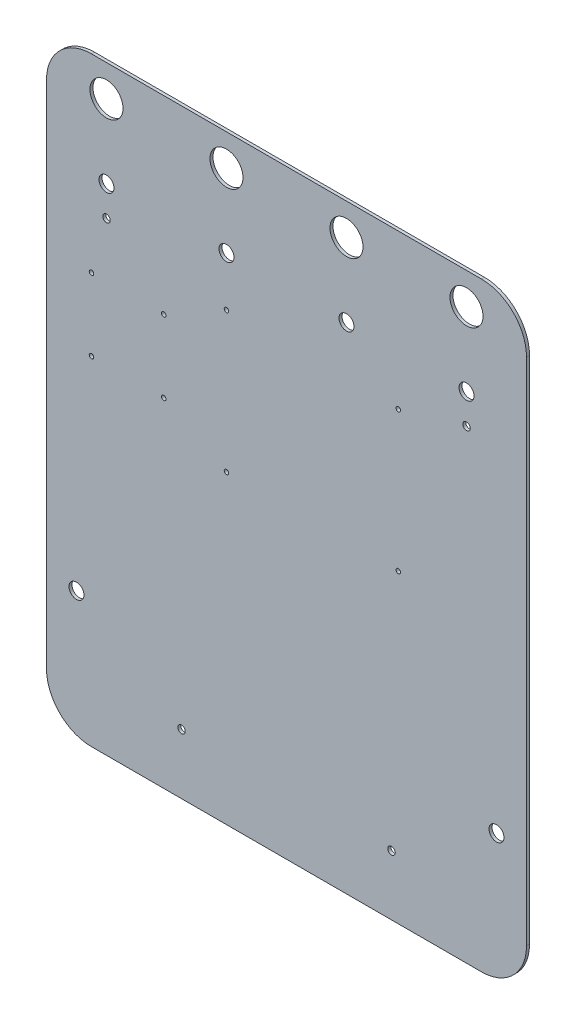
ISO-10303-21;
HEADER;
FILE_DESCRIPTION(('STEP AP214'),'2;1');
FILE_NAME('part.step','',(''),(''),'','','');
FILE_SCHEMA(('AUTOMOTIVE_DESIGN { 1 0 10303 214 1 1 1 1 }'));
ENDSEC;
DATA;
#1=APPLICATION_CONTEXT('core data for automotive mechanical design processes');
#2=APPLICATION_PROTOCOL_DEFINITION('international standard','automotive_design',2000,#1);
#3=PRODUCT_CONTEXT('',#1,'mechanical');
#4=PRODUCT('Part','Part','',(#3));
#5=PRODUCT_RELATED_PRODUCT_CATEGORY('part','',(#4));
#6=PRODUCT_DEFINITION_FORMATION('','',#4);
#7=PRODUCT_DEFINITION_CONTEXT('part definition',#1,'design');
#8=PRODUCT_DEFINITION('design','',#6,#7);
#9=PRODUCT_DEFINITION_SHAPE('','',#8);
#10=(LENGTH_UNIT() NAMED_UNIT(*) SI_UNIT(.MILLI.,.METRE.));
#11=(NAMED_UNIT(*) PLANE_ANGLE_UNIT() SI_UNIT($,.RADIAN.));
#12=(NAMED_UNIT(*) SI_UNIT($,.STERADIAN.) SOLID_ANGLE_UNIT());
#13=UNCERTAINTY_MEASURE_WITH_UNIT(LENGTH_MEASURE(1.E-05),#10,'distance_accuracy_value','');
#14=(GEOMETRIC_REPRESENTATION_CONTEXT(3) GLOBAL_UNCERTAINTY_ASSIGNED_CONTEXT((#13)) GLOBAL_UNIT_ASSIGNED_CONTEXT((#10,
#11,#12)) REPRESENTATION_CONTEXT('',''));
#15=CARTESIAN_POINT('',(0.,0.,0.));
#16=DIRECTION('',(0.,0.,1.));
#17=DIRECTION('',(1.,0.,0.));
#18=AXIS2_PLACEMENT_3D('',#15,#16,#17);
#19=CARTESIAN_POINT('',(59.4029850746268,-20.,2.));
#20=DIRECTION('',(0.,0.,1.));
#21=DIRECTION('',(1.,0.,0.));
#22=AXIS2_PLACEMENT_3D('',#19,#20,#21);
#23=PLANE('',#22);
#24=CARTESIAN_POINT('',(-200.598097779219,175.469448038988,2.));
#25=DIRECTION('',(0.,0.,1.));
#26=DIRECTION('',(1.,0.,0.));
#27=AXIS2_PLACEMENT_3D('',#24,#25,#26);
#28=CIRCLE('',#27,1.5);
#29=CARTESIAN_POINT('',(-199.098097779219,175.469448038988,2.));
#30=VERTEX_POINT('',#29);
#31=EDGE_CURVE('E300',#30,#30,#28,.T.);
#32=ORIENTED_EDGE('',*,*,#31,.F.);
#33=EDGE_LOOP('',(#32));
#34=FACE_BOUND('',#33,.T.);
#35=CARTESIAN_POINT('',(-200.598097779219,223.669448038988,2.));
#36=DIRECTION('',(0.,0.,1.));
#37=DIRECTION('',(1.,0.,0.));
#38=AXIS2_PLACEMENT_3D('',#35,#36,#37);
#39=CIRCLE('',#38,1.49999999999995);
#40=CARTESIAN_POINT('',(-199.098097779219,223.669448038988,2.));
#41=VERTEX_POINT('',#40);
#42=EDGE_CURVE('E288',#41,#41,#39,.T.);
#43=ORIENTED_EDGE('',*,*,#42,.F.);
#44=EDGE_LOOP('',(#43));
#45=FACE_BOUND('',#44,.T.);
#46=CARTESIAN_POINT('',(3.90070572618083,153.604711047451,2.));
#47=DIRECTION('',(0.,0.,1.));
#48=DIRECTION('',(1.,0.,0.));
#49=AXIS2_PLACEMENT_3D('',#46,#47,#48);
#50=CIRCLE('',#49,1.5);
#51=CARTESIAN_POINT('',(5.40070572618083,153.604711047451,2.));
#52=VERTEX_POINT('',#51);
#53=EDGE_CURVE('E276',#52,#52,#50,.T.);
#54=ORIENTED_EDGE('',*,*,#53,.F.);
#55=EDGE_LOOP('',(#54));
#56=FACE_BOUND('',#55,.T.);
#57=CARTESIAN_POINT('',(49.4052224955762,280.,2.));
#58=DIRECTION('',(0.,0.,1.));
#59=DIRECTION('',(1.,0.,0.));
#60=AXIS2_PLACEMENT_3D('',#57,#58,#59);
#61=CIRCLE('',#60,5.);
#62=CARTESIAN_POINT('',(54.4052224955762,280.,2.));
#63=VERTEX_POINT('',#62);
#64=EDGE_CURVE('E264',#63,#63,#61,.T.);
#65=ORIENTED_EDGE('',*,*,#64,.F.);
#66=EDGE_LOOP('',(#65));
#67=FACE_BOUND('',#66,.T.);
#68=CARTESIAN_POINT('',(-30.5970149253732,280.,2.));
#69=DIRECTION('',(0.,0.,1.));
#70=DIRECTION('',(1.,0.,0.));
#71=AXIS2_PLACEMENT_3D('',#68,#69,#70);
#72=CIRCLE('',#71,5.);
#73=CARTESIAN_POINT('',(-25.5970149253732,280.,2.));
#74=VERTEX_POINT('',#73);
#75=EDGE_CURVE('E252',#74,#74,#72,.T.);
#76=ORIENTED_EDGE('',*,*,#75,.F.);
#77=EDGE_LOOP('',(#76));
#78=FACE_BOUND('',#77,.T.);
#79=CARTESIAN_POINT('',(69.4029850746269,35.,2.));
#80=DIRECTION('',(0.,0.,1.));
#81=DIRECTION('',(1.,0.,0.));
#82=AXIS2_PLACEMENT_3D('',#79,#80,#81);
#83=CIRCLE('',#82,5.00000000000001);
#84=CARTESIAN_POINT('',(74.4029850746269,35.,2.));
#85=VERTEX_POINT('',#84);
#86=EDGE_CURVE('E240',#85,#85,#83,.T.);
#87=ORIENTED_EDGE('',*,*,#86,.F.);
#88=EDGE_LOOP('',(#87));
#89=FACE_BOUND('',#88,.T.);
#90=CARTESIAN_POINT('',(-190.594777504424,280.,2.));
#91=DIRECTION('',(0.,0.,1.));
#92=DIRECTION('',(1.,0.,0.));
#93=AXIS2_PLACEMENT_3D('',#90,#91,#92);
#94=CIRCLE('',#93,5.00000000000002);
#95=CARTESIAN_POINT('',(-185.594777504424,280.,2.));
#96=VERTEX_POINT('',#95);
#97=EDGE_CURVE('E228',#96,#96,#94,.T.);
#98=ORIENTED_EDGE('',*,*,#97,.F.);
#99=EDGE_LOOP('',(#98));
#100=FACE_BOUND('',#99,.T.);
#101=CARTESIAN_POINT('',(-190.597014925373,329.,2.));
#102=DIRECTION('',(0.,0.,1.));
#103=DIRECTION('',(1.,0.,0.));
#104=AXIS2_PLACEMENT_3D('',#101,#102,#103);
#105=CIRCLE('',#104,11.);
#106=CARTESIAN_POINT('',(-179.597014925373,329.,2.));
#107=VERTEX_POINT('',#106);
#108=EDGE_CURVE('E216',#107,#107,#105,.T.);
#109=ORIENTED_EDGE('',*,*,#108,.F.);
#110=EDGE_LOOP('',(#109));
#111=FACE_BOUND('',#110,.T.);
#112=CARTESIAN_POINT('',(49.4029850746268,329.,2.));
#113=DIRECTION('',(0.,0.,1.));
#114=DIRECTION('',(1.,0.,0.));
#115=AXIS2_PLACEMENT_3D('',#112,#113,#114);
#116=CIRCLE('',#115,11.);
#117=CARTESIAN_POINT('',(60.4029850746268,329.,2.));
#118=VERTEX_POINT('',#117);
#119=EDGE_CURVE('E204',#118,#118,#116,.T.);
#120=ORIENTED_EDGE('',*,*,#119,.F.);
#121=EDGE_LOOP('',(#120));
#122=FACE_BOUND('',#121,.T.);
#123=CARTESIAN_POINT('',(-140.594777504424,-9.99740760924141,2.));
#124=DIRECTION('',(0.,0.,1.));
#125=DIRECTION('',(1.,0.,0.));
#126=AXIS2_PLACEMENT_3D('',#123,#124,#125);
#127=CIRCLE('',#126,2.5);
#128=CARTESIAN_POINT('',(-138.094777504424,-9.99740760924141,2.));
#129=VERTEX_POINT('',#128);
#130=EDGE_CURVE('E192',#129,#129,#127,.T.);
#131=ORIENTED_EDGE('',*,*,#130,.F.);
#132=EDGE_LOOP('',(#131));
#133=FACE_BOUND('',#132,.T.);
#134=CARTESIAN_POINT('',(-190.594777504424,260.002592390759,2.));
#135=DIRECTION('',(0.,0.,1.));
#136=DIRECTION('',(1.,0.,0.));
#137=AXIS2_PLACEMENT_3D('',#134,#135,#136);
#138=CIRCLE('',#137,2.5);
#139=CARTESIAN_POINT('',(-188.094777504424,260.002592390759,2.));
#140=VERTEX_POINT('',#139);
#141=EDGE_CURVE('E138',#140,#140,#138,.T.);
#142=ORIENTED_EDGE('',*,*,#141,.F.);
#143=EDGE_LOOP('',(#142));
#144=FACE_BOUND('',#143,.T.);
#145=CARTESIAN_POINT('',(59.4029850746268,-20.,2.));
#146=DIRECTION('',(0.,0.,1.));
#147=DIRECTION('',(1.,0.,0.));
#148=AXIS2_PLACEMENT_3D('',#145,#146,#147);
#149=CIRCLE('',#148,30.);
#150=CARTESIAN_POINT('',(59.4029850746266,-50.,2.));
#151=VERTEX_POINT('',#150);
#152=CARTESIAN_POINT('',(89.4029850746269,-20.,2.));
#153=VERTEX_POINT('',#152);
#154=EDGE_CURVE('E149',#151,#153,#149,.T.);
#155=ORIENTED_EDGE('',*,*,#154,.T.);
#156=DIRECTION('',(0.,1.,0.));
#157=VECTOR('',#156,1.);
#158=CARTESIAN_POINT('',(89.4029850746268,320.,2.));
#159=LINE('',#158,#157);
#160=CARTESIAN_POINT('',(89.4029850746268,320.,2.));
#161=VERTEX_POINT('',#160);
#162=EDGE_CURVE('E97',#153,#161,#159,.T.);
#163=ORIENTED_EDGE('',*,*,#162,.T.);
#164=CARTESIAN_POINT('',(59.4029850746268,320.,2.));
#165=DIRECTION('',(0.,0.,1.));
#166=DIRECTION('',(-1.,0.,0.));
#167=AXIS2_PLACEMENT_3D('',#164,#165,#166);
#168=CIRCLE('',#167,30.);
#169=CARTESIAN_POINT('',(59.4029850746266,350.,2.));
#170=VERTEX_POINT('',#169);
#171=EDGE_CURVE('E164',#161,#170,#168,.T.);
#172=ORIENTED_EDGE('',*,*,#171,.T.);
#173=DIRECTION('',(-1.,0.,0.));
#174=VECTOR('',#173,1.);
#175=CARTESIAN_POINT('',(-200.597014925373,350.,2.));
#176=LINE('',#175,#174);
#177=CARTESIAN_POINT('',(-200.597014925373,350.,2.));
#178=VERTEX_POINT('',#177);
#179=EDGE_CURVE('E177',#170,#178,#176,.T.);
#180=ORIENTED_EDGE('',*,*,#179,.T.);
#181=CARTESIAN_POINT('',(-200.597014925373,320.,2.));
#182=DIRECTION('',(0.,0.,1.));
#183=DIRECTION('',(1.,0.,0.));
#184=AXIS2_PLACEMENT_3D('',#181,#182,#183);
#185=CIRCLE('',#184,30.);
#186=CARTESIAN_POINT('',(-230.597014925373,320.,2.));
#187=VERTEX_POINT('',#186);
#188=EDGE_CURVE('E116',#178,#187,#185,.T.);
#189=ORIENTED_EDGE('',*,*,#188,.T.);
#190=DIRECTION('',(0.,-1.,0.));
#191=VECTOR('',#190,1.);
#192=CARTESIAN_POINT('',(-230.597014925373,320.,2.));
#193=LINE('',#192,#191);
#194=CARTESIAN_POINT('',(-230.597014925373,-20.,2.));
#195=VERTEX_POINT('',#194);
#196=EDGE_CURVE('E110',#187,#195,#193,.T.);
#197=ORIENTED_EDGE('',*,*,#196,.T.);
#198=CARTESIAN_POINT('',(-200.597014925373,-20.,2.));
#199=DIRECTION('',(0.,0.,1.));
#200=DIRECTION('',(1.,0.,0.));
#201=AXIS2_PLACEMENT_3D('',#198,#199,#200);
#202=CIRCLE('',#201,30.);
#203=CARTESIAN_POINT('',(-200.597014925373,-50.,2.));
#204=VERTEX_POINT('',#203);
#205=EDGE_CURVE('E114',#195,#204,#202,.T.);
#206=ORIENTED_EDGE('',*,*,#205,.T.);
#207=DIRECTION('',(1.,0.,0.));
#208=VECTOR('',#207,1.);
#209=CARTESIAN_POINT('',(-200.597014925373,-50.,2.));
#210=LINE('',#209,#208);
#211=EDGE_CURVE('E54',#204,#151,#210,.T.);
#212=ORIENTED_EDGE('',*,*,#211,.T.);
#213=EDGE_LOOP('',(#155,#163,#172,#180,#189,#197,#206,#212));
#214=FACE_BOUND('',#213,.T.);
#215=CARTESIAN_POINT('',(49.4052224955762,260.002592390759,2.));
#216=DIRECTION('',(0.,0.,1.));
#217=DIRECTION('',(1.,0.,0.));
#218=AXIS2_PLACEMENT_3D('',#215,#216,#217);
#219=CIRCLE('',#218,2.5);
#220=CARTESIAN_POINT('',(51.9052224955762,260.002592390759,2.));
#221=VERTEX_POINT('',#220);
#222=EDGE_CURVE('E186',#221,#221,#219,.T.);
#223=ORIENTED_EDGE('',*,*,#222,.F.);
#224=EDGE_LOOP('',(#223));
#225=FACE_BOUND('',#224,.T.);
#226=CARTESIAN_POINT('',(-0.594777504423762,-9.99740760924142,2.));
#227=DIRECTION('',(0.,0.,1.));
#228=DIRECTION('',(1.,0.,0.));
#229=AXIS2_PLACEMENT_3D('',#226,#227,#228);
#230=CIRCLE('',#229,2.5);
#231=CARTESIAN_POINT('',(1.90522249557624,-9.99740760924142,2.));
#232=VERTEX_POINT('',#231);
#233=EDGE_CURVE('E198',#232,#232,#230,.T.);
#234=ORIENTED_EDGE('',*,*,#233,.F.);
#235=EDGE_LOOP('',(#234));
#236=FACE_BOUND('',#235,.T.);
#237=CARTESIAN_POINT('',(-110.597014925373,329.,2.));
#238=DIRECTION('',(0.,0.,1.));
#239=DIRECTION('',(1.,0.,0.));
#240=AXIS2_PLACEMENT_3D('',#237,#238,#239);
#241=CIRCLE('',#240,11.);
#242=CARTESIAN_POINT('',(-99.5970149253732,329.,2.));
#243=VERTEX_POINT('',#242);
#244=EDGE_CURVE('E210',#243,#243,#241,.T.);
#245=ORIENTED_EDGE('',*,*,#244,.F.);
#246=EDGE_LOOP('',(#245));
#247=FACE_BOUND('',#246,.T.);
#248=CARTESIAN_POINT('',(-30.5970149253732,329.,2.));
#249=DIRECTION('',(0.,0.,1.));
#250=DIRECTION('',(1.,0.,0.));
#251=AXIS2_PLACEMENT_3D('',#248,#249,#250);
#252=CIRCLE('',#251,11.);
#253=CARTESIAN_POINT('',(-19.5970149253732,329.,2.));
#254=VERTEX_POINT('',#253);
#255=EDGE_CURVE('E222',#254,#254,#252,.T.);
#256=ORIENTED_EDGE('',*,*,#255,.F.);
#257=EDGE_LOOP('',(#256));
#258=FACE_BOUND('',#257,.T.);
#259=CARTESIAN_POINT('',(-210.597014925373,35.,2.));
#260=DIRECTION('',(0.,0.,1.));
#261=DIRECTION('',(1.,0.,0.));
#262=AXIS2_PLACEMENT_3D('',#259,#260,#261);
#263=CIRCLE('',#262,5.00000000000002);
#264=CARTESIAN_POINT('',(-205.597014925373,35.,2.));
#265=VERTEX_POINT('',#264);
#266=EDGE_CURVE('E234',#265,#265,#263,.T.);
#267=ORIENTED_EDGE('',*,*,#266,.F.);
#268=EDGE_LOOP('',(#267));
#269=FACE_BOUND('',#268,.T.);
#270=CARTESIAN_POINT('',(-110.599294273819,280.,2.));
#271=DIRECTION('',(0.,0.,1.));
#272=DIRECTION('',(1.,0.,0.));
#273=AXIS2_PLACEMENT_3D('',#270,#271,#272);
#274=CIRCLE('',#273,5.00000000000001);
#275=CARTESIAN_POINT('',(-105.599294273819,280.,2.));
#276=VERTEX_POINT('',#275);
#277=EDGE_CURVE('E246',#276,#276,#274,.T.);
#278=ORIENTED_EDGE('',*,*,#277,.F.);
#279=EDGE_LOOP('',(#278));
#280=FACE_BOUND('',#279,.T.);
#281=CARTESIAN_POINT('',(-110.599294273819,247.104711047452,2.));
#282=DIRECTION('',(0.,0.,1.));
#283=DIRECTION('',(1.,0.,0.));
#284=AXIS2_PLACEMENT_3D('',#281,#282,#283);
#285=CIRCLE('',#284,1.49999999999993);
#286=CARTESIAN_POINT('',(-109.099294273819,247.104711047452,2.));
#287=VERTEX_POINT('',#286);
#288=EDGE_CURVE('E258',#287,#287,#285,.T.);
#289=ORIENTED_EDGE('',*,*,#288,.F.);
#290=EDGE_LOOP('',(#289));
#291=FACE_BOUND('',#290,.T.);
#292=CARTESIAN_POINT('',(-110.599294273819,153.604711047452,2.));
#293=DIRECTION('',(0.,0.,1.));
#294=DIRECTION('',(1.,0.,0.));
#295=AXIS2_PLACEMENT_3D('',#292,#293,#294);
#296=CIRCLE('',#295,1.49999999999997);
#297=CARTESIAN_POINT('',(-109.099294273819,153.604711047452,2.));
#298=VERTEX_POINT('',#297);
#299=EDGE_CURVE('E270',#298,#298,#296,.T.);
#300=ORIENTED_EDGE('',*,*,#299,.F.);
#301=EDGE_LOOP('',(#300));
#302=FACE_BOUND('',#301,.T.);
#303=CARTESIAN_POINT('',(3.90070572618081,247.104711047452,2.));
#304=DIRECTION('',(0.,0.,1.));
#305=DIRECTION('',(1.,0.,0.));
#306=AXIS2_PLACEMENT_3D('',#303,#304,#305);
#307=CIRCLE('',#306,1.49999999999985);
#308=CARTESIAN_POINT('',(5.40070572618066,247.104711047452,2.));
#309=VERTEX_POINT('',#308);
#310=EDGE_CURVE('E282',#309,#309,#307,.T.);
#311=ORIENTED_EDGE('',*,*,#310,.F.);
#312=EDGE_LOOP('',(#311));
#313=FACE_BOUND('',#312,.T.);
#314=CARTESIAN_POINT('',(-152.398097779219,223.669448038988,2.));
#315=DIRECTION('',(0.,0.,1.));
#316=DIRECTION('',(1.,0.,0.));
#317=AXIS2_PLACEMENT_3D('',#314,#315,#316);
#318=CIRCLE('',#317,1.49999999999995);
#319=CARTESIAN_POINT('',(-150.898097779219,223.669448038988,2.));
#320=VERTEX_POINT('',#319);
#321=EDGE_CURVE('E294',#320,#320,#318,.T.);
#322=ORIENTED_EDGE('',*,*,#321,.F.);
#323=EDGE_LOOP('',(#322));
#324=FACE_BOUND('',#323,.T.);
#325=CARTESIAN_POINT('',(-152.398097779219,175.469448038988,2.));
#326=DIRECTION('',(0.,0.,1.));
#327=DIRECTION('',(1.,0.,0.));
#328=AXIS2_PLACEMENT_3D('',#325,#326,#327);
#329=CIRCLE('',#328,1.49999999999982);
#330=CARTESIAN_POINT('',(-150.898097779219,175.469448038988,2.));
#331=VERTEX_POINT('',#330);
#332=EDGE_CURVE('E306',#331,#331,#329,.T.);
#333=ORIENTED_EDGE('',*,*,#332,.F.);
#334=EDGE_LOOP('',(#333));
#335=FACE_BOUND('',#334,.T.);
#336=ADVANCED_FACE('F37',(#34,#45,#56,#67,#78,#89,#100,#111,#122,#133,#144,#214,#225,#236,#247,
#258,#269,#280,#291,#302,#313,#324,#335),#23,.T.);
#337=CARTESIAN_POINT('',(59.4029850746268,-20.,0.));
#338=DIRECTION('',(0.,0.,1.));
#339=DIRECTION('',(1.,0.,0.));
#340=AXIS2_PLACEMENT_3D('',#337,#338,#339);
#341=PLANE('',#340);
#342=CARTESIAN_POINT('',(59.4029850746268,-20.,0.));
#343=DIRECTION('',(0.,0.,1.));
#344=DIRECTION('',(1.,0.,0.));
#345=AXIS2_PLACEMENT_3D('',#342,#343,#344);
#346=CIRCLE('',#345,30.);
#347=CARTESIAN_POINT('',(59.4029850746266,-50.,0.));
#348=VERTEX_POINT('',#347);
#349=CARTESIAN_POINT('',(89.4029850746269,-20.,0.));
#350=VERTEX_POINT('',#349);
#351=EDGE_CURVE('E134',#348,#350,#346,.T.);
#352=ORIENTED_EDGE('',*,*,#351,.F.);
#353=DIRECTION('',(1.,0.,0.));
#354=VECTOR('',#353,1.);
#355=CARTESIAN_POINT('',(-200.597014925373,-50.,0.));
#356=LINE('',#355,#354);
#357=CARTESIAN_POINT('',(-200.597014925373,-50.,0.));
#358=VERTEX_POINT('',#357);
#359=EDGE_CURVE('E89',#358,#348,#356,.T.);
#360=ORIENTED_EDGE('',*,*,#359,.F.);
#361=CARTESIAN_POINT('',(-200.597014925373,-20.,0.));
#362=DIRECTION('',(0.,0.,1.));
#363=DIRECTION('',(1.,0.,0.));
#364=AXIS2_PLACEMENT_3D('',#361,#362,#363);
#365=CIRCLE('',#364,30.);
#366=CARTESIAN_POINT('',(-230.597014925373,-20.,0.));
#367=VERTEX_POINT('',#366);
#368=EDGE_CURVE('E83',#367,#358,#365,.T.);
#369=ORIENTED_EDGE('',*,*,#368,.F.);
#370=DIRECTION('',(0.,-1.,0.));
#371=VECTOR('',#370,1.);
#372=CARTESIAN_POINT('',(-230.597014925373,320.,0.));
#373=LINE('',#372,#371);
#374=CARTESIAN_POINT('',(-230.597014925373,320.,0.));
#375=VERTEX_POINT('',#374);
#376=EDGE_CURVE('E124',#375,#367,#373,.T.);
#377=ORIENTED_EDGE('',*,*,#376,.F.);
#378=CARTESIAN_POINT('',(-200.597014925373,320.,0.));
#379=DIRECTION('',(0.,0.,1.));
#380=DIRECTION('',(1.,0.,0.));
#381=AXIS2_PLACEMENT_3D('',#378,#379,#380);
#382=CIRCLE('',#381,30.);
#383=CARTESIAN_POINT('',(-200.597014925373,350.,0.));
#384=VERTEX_POINT('',#383);
#385=EDGE_CURVE('E144',#384,#375,#382,.T.);
#386=ORIENTED_EDGE('',*,*,#385,.F.);
#387=DIRECTION('',(-1.,0.,0.));
#388=VECTOR('',#387,1.);
#389=CARTESIAN_POINT('',(-200.597014925373,350.,0.));
#390=LINE('',#389,#388);
#391=CARTESIAN_POINT('',(59.4029850746266,350.,0.));
#392=VERTEX_POINT('',#391);
#393=EDGE_CURVE('E142',#392,#384,#390,.T.);
#394=ORIENTED_EDGE('',*,*,#393,.F.);
#395=CARTESIAN_POINT('',(59.4029850746268,320.,0.));
#396=DIRECTION('',(0.,0.,1.));
#397=DIRECTION('',(-1.,0.,0.));
#398=AXIS2_PLACEMENT_3D('',#395,#396,#397);
#399=CIRCLE('',#398,30.);
#400=CARTESIAN_POINT('',(89.4029850746268,320.,0.));
#401=VERTEX_POINT('',#400);
#402=EDGE_CURVE('E140',#401,#392,#399,.T.);
#403=ORIENTED_EDGE('',*,*,#402,.F.);
#404=DIRECTION('',(0.,1.,0.));
#405=VECTOR('',#404,1.);
#406=CARTESIAN_POINT('',(89.4029850746268,320.,0.));
#407=LINE('',#406,#405);
#408=EDGE_CURVE('E137',#350,#401,#407,.T.);
#409=ORIENTED_EDGE('',*,*,#408,.F.);
#410=EDGE_LOOP('',(#352,#360,#369,#377,#386,#394,#403,#409));
#411=FACE_BOUND('',#410,.T.);
#412=CARTESIAN_POINT('',(-190.594777504424,260.002592390759,0.));
#413=DIRECTION('',(0.,0.,1.));
#414=DIRECTION('',(1.,0.,0.));
#415=AXIS2_PLACEMENT_3D('',#412,#413,#414);
#416=CIRCLE('',#415,2.5);
#417=CARTESIAN_POINT('',(-188.094777504424,260.002592390759,0.));
#418=VERTEX_POINT('',#417);
#419=EDGE_CURVE('E183',#418,#418,#416,.T.);
#420=ORIENTED_EDGE('',*,*,#419,.T.);
#421=EDGE_LOOP('',(#420));
#422=FACE_BOUND('',#421,.T.);
#423=CARTESIAN_POINT('',(49.4052224955762,260.002592390759,0.));
#424=DIRECTION('',(0.,0.,1.));
#425=DIRECTION('',(1.,0.,0.));
#426=AXIS2_PLACEMENT_3D('',#423,#424,#425);
#427=CIRCLE('',#426,2.5);
#428=CARTESIAN_POINT('',(51.9052224955762,260.002592390759,0.));
#429=VERTEX_POINT('',#428);
#430=EDGE_CURVE('E189',#429,#429,#427,.T.);
#431=ORIENTED_EDGE('',*,*,#430,.T.);
#432=EDGE_LOOP('',(#431));
#433=FACE_BOUND('',#432,.T.);
#434=CARTESIAN_POINT('',(-140.594777504424,-9.99740760924141,0.));
#435=DIRECTION('',(0.,0.,1.));
#436=DIRECTION('',(1.,0.,0.));
#437=AXIS2_PLACEMENT_3D('',#434,#435,#436);
#438=CIRCLE('',#437,2.5);
#439=CARTESIAN_POINT('',(-138.094777504424,-9.99740760924141,0.));
#440=VERTEX_POINT('',#439);
#441=EDGE_CURVE('E195',#440,#440,#438,.T.);
#442=ORIENTED_EDGE('',*,*,#441,.T.);
#443=EDGE_LOOP('',(#442));
#444=FACE_BOUND('',#443,.T.);
#445=CARTESIAN_POINT('',(-0.594777504423762,-9.99740760924142,0.));
#446=DIRECTION('',(0.,0.,1.));
#447=DIRECTION('',(1.,0.,0.));
#448=AXIS2_PLACEMENT_3D('',#445,#446,#447);
#449=CIRCLE('',#448,2.5);
#450=CARTESIAN_POINT('',(1.90522249557624,-9.99740760924142,0.));
#451=VERTEX_POINT('',#450);
#452=EDGE_CURVE('E201',#451,#451,#449,.T.);
#453=ORIENTED_EDGE('',*,*,#452,.T.);
#454=EDGE_LOOP('',(#453));
#455=FACE_BOUND('',#454,.T.);
#456=CARTESIAN_POINT('',(49.4029850746268,329.,0.));
#457=DIRECTION('',(0.,0.,1.));
#458=DIRECTION('',(1.,0.,0.));
#459=AXIS2_PLACEMENT_3D('',#456,#457,#458);
#460=CIRCLE('',#459,11.);
#461=CARTESIAN_POINT('',(60.4029850746268,329.,0.));
#462=VERTEX_POINT('',#461);
#463=EDGE_CURVE('E207',#462,#462,#460,.T.);
#464=ORIENTED_EDGE('',*,*,#463,.T.);
#465=EDGE_LOOP('',(#464));
#466=FACE_BOUND('',#465,.T.);
#467=CARTESIAN_POINT('',(-110.597014925373,329.,0.));
#468=DIRECTION('',(0.,0.,1.));
#469=DIRECTION('',(1.,0.,0.));
#470=AXIS2_PLACEMENT_3D('',#467,#468,#469);
#471=CIRCLE('',#470,11.);
#472=CARTESIAN_POINT('',(-99.5970149253732,329.,0.));
#473=VERTEX_POINT('',#472);
#474=EDGE_CURVE('E213',#473,#473,#471,.T.);
#475=ORIENTED_EDGE('',*,*,#474,.T.);
#476=EDGE_LOOP('',(#475));
#477=FACE_BOUND('',#476,.T.);
#478=CARTESIAN_POINT('',(-190.597014925373,329.,0.));
#479=DIRECTION('',(0.,0.,1.));
#480=DIRECTION('',(1.,0.,0.));
#481=AXIS2_PLACEMENT_3D('',#478,#479,#480);
#482=CIRCLE('',#481,11.);
#483=CARTESIAN_POINT('',(-179.597014925373,329.,0.));
#484=VERTEX_POINT('',#483);
#485=EDGE_CURVE('E219',#484,#484,#482,.T.);
#486=ORIENTED_EDGE('',*,*,#485,.T.);
#487=EDGE_LOOP('',(#486));
#488=FACE_BOUND('',#487,.T.);
#489=CARTESIAN_POINT('',(-30.5970149253732,329.,0.));
#490=DIRECTION('',(0.,0.,1.));
#491=DIRECTION('',(1.,0.,0.));
#492=AXIS2_PLACEMENT_3D('',#489,#490,#491);
#493=CIRCLE('',#492,11.);
#494=CARTESIAN_POINT('',(-19.5970149253732,329.,0.));
#495=VERTEX_POINT('',#494);
#496=EDGE_CURVE('E225',#495,#495,#493,.T.);
#497=ORIENTED_EDGE('',*,*,#496,.T.);
#498=EDGE_LOOP('',(#497));
#499=FACE_BOUND('',#498,.T.);
#500=CARTESIAN_POINT('',(-190.594777504424,280.,0.));
#501=DIRECTION('',(0.,0.,1.));
#502=DIRECTION('',(1.,0.,0.));
#503=AXIS2_PLACEMENT_3D('',#500,#501,#502);
#504=CIRCLE('',#503,5.00000000000002);
#505=CARTESIAN_POINT('',(-185.594777504424,280.,0.));
#506=VERTEX_POINT('',#505);
#507=EDGE_CURVE('E231',#506,#506,#504,.T.);
#508=ORIENTED_EDGE('',*,*,#507,.T.);
#509=EDGE_LOOP('',(#508));
#510=FACE_BOUND('',#509,.T.);
#511=CARTESIAN_POINT('',(-210.597014925373,35.,0.));
#512=DIRECTION('',(0.,0.,1.));
#513=DIRECTION('',(1.,0.,0.));
#514=AXIS2_PLACEMENT_3D('',#511,#512,#513);
#515=CIRCLE('',#514,5.00000000000002);
#516=CARTESIAN_POINT('',(-205.597014925373,35.,0.));
#517=VERTEX_POINT('',#516);
#518=EDGE_CURVE('E237',#517,#517,#515,.T.);
#519=ORIENTED_EDGE('',*,*,#518,.T.);
#520=EDGE_LOOP('',(#519));
#521=FACE_BOUND('',#520,.T.);
#522=CARTESIAN_POINT('',(69.4029850746269,35.,0.));
#523=DIRECTION('',(0.,0.,1.));
#524=DIRECTION('',(1.,0.,0.));
#525=AXIS2_PLACEMENT_3D('',#522,#523,#524);
#526=CIRCLE('',#525,5.00000000000001);
#527=CARTESIAN_POINT('',(74.4029850746269,35.,0.));
#528=VERTEX_POINT('',#527);
#529=EDGE_CURVE('E243',#528,#528,#526,.T.);
#530=ORIENTED_EDGE('',*,*,#529,.T.);
#531=EDGE_LOOP('',(#530));
#532=FACE_BOUND('',#531,.T.);
#533=CARTESIAN_POINT('',(-110.599294273819,280.,0.));
#534=DIRECTION('',(0.,0.,1.));
#535=DIRECTION('',(1.,0.,0.));
#536=AXIS2_PLACEMENT_3D('',#533,#534,#535);
#537=CIRCLE('',#536,5.00000000000001);
#538=CARTESIAN_POINT('',(-105.599294273819,280.,0.));
#539=VERTEX_POINT('',#538);
#540=EDGE_CURVE('E249',#539,#539,#537,.T.);
#541=ORIENTED_EDGE('',*,*,#540,.T.);
#542=EDGE_LOOP('',(#541));
#543=FACE_BOUND('',#542,.T.);
#544=CARTESIAN_POINT('',(-30.5970149253732,280.,0.));
#545=DIRECTION('',(0.,0.,1.));
#546=DIRECTION('',(1.,0.,0.));
#547=AXIS2_PLACEMENT_3D('',#544,#545,#546);
#548=CIRCLE('',#547,5.);
#549=CARTESIAN_POINT('',(-25.5970149253732,280.,0.));
#550=VERTEX_POINT('',#549);
#551=EDGE_CURVE('E255',#550,#550,#548,.T.);
#552=ORIENTED_EDGE('',*,*,#551,.T.);
#553=EDGE_LOOP('',(#552));
#554=FACE_BOUND('',#553,.T.);
#555=CARTESIAN_POINT('',(-110.599294273819,247.104711047452,0.));
#556=DIRECTION('',(0.,0.,1.));
#557=DIRECTION('',(1.,0.,0.));
#558=AXIS2_PLACEMENT_3D('',#555,#556,#557);
#559=CIRCLE('',#558,1.49999999999993);
#560=CARTESIAN_POINT('',(-109.099294273819,247.104711047452,0.));
#561=VERTEX_POINT('',#560);
#562=EDGE_CURVE('E261',#561,#561,#559,.T.);
#563=ORIENTED_EDGE('',*,*,#562,.T.);
#564=EDGE_LOOP('',(#563));
#565=FACE_BOUND('',#564,.T.);
#566=CARTESIAN_POINT('',(49.4052224955762,280.,0.));
#567=DIRECTION('',(0.,0.,1.));
#568=DIRECTION('',(1.,0.,0.));
#569=AXIS2_PLACEMENT_3D('',#566,#567,#568);
#570=CIRCLE('',#569,5.);
#571=CARTESIAN_POINT('',(54.4052224955762,280.,0.));
#572=VERTEX_POINT('',#571);
#573=EDGE_CURVE('E267',#572,#572,#570,.T.);
#574=ORIENTED_EDGE('',*,*,#573,.T.);
#575=EDGE_LOOP('',(#574));
#576=FACE_BOUND('',#575,.T.);
#577=CARTESIAN_POINT('',(-110.599294273819,153.604711047452,0.));
#578=DIRECTION('',(0.,0.,1.));
#579=DIRECTION('',(1.,0.,0.));
#580=AXIS2_PLACEMENT_3D('',#577,#578,#579);
#581=CIRCLE('',#580,1.49999999999997);
#582=CARTESIAN_POINT('',(-109.099294273819,153.604711047452,0.));
#583=VERTEX_POINT('',#582);
#584=EDGE_CURVE('E273',#583,#583,#581,.T.);
#585=ORIENTED_EDGE('',*,*,#584,.T.);
#586=EDGE_LOOP('',(#585));
#587=FACE_BOUND('',#586,.T.);
#588=CARTESIAN_POINT('',(3.90070572618083,153.604711047451,0.));
#589=DIRECTION('',(0.,0.,1.));
#590=DIRECTION('',(1.,0.,0.));
#591=AXIS2_PLACEMENT_3D('',#588,#589,#590);
#592=CIRCLE('',#591,1.5);
#593=CARTESIAN_POINT('',(5.40070572618083,153.604711047451,0.));
#594=VERTEX_POINT('',#593);
#595=EDGE_CURVE('E279',#594,#594,#592,.T.);
#596=ORIENTED_EDGE('',*,*,#595,.T.);
#597=EDGE_LOOP('',(#596));
#598=FACE_BOUND('',#597,.T.);
#599=CARTESIAN_POINT('',(3.90070572618081,247.104711047452,0.));
#600=DIRECTION('',(0.,0.,1.));
#601=DIRECTION('',(1.,0.,0.));
#602=AXIS2_PLACEMENT_3D('',#599,#600,#601);
#603=CIRCLE('',#602,1.49999999999985);
#604=CARTESIAN_POINT('',(5.40070572618066,247.104711047452,0.));
#605=VERTEX_POINT('',#604);
#606=EDGE_CURVE('E285',#605,#605,#603,.T.);
#607=ORIENTED_EDGE('',*,*,#606,.T.);
#608=EDGE_LOOP('',(#607));
#609=FACE_BOUND('',#608,.T.);
#610=CARTESIAN_POINT('',(-200.598097779219,223.669448038988,0.));
#611=DIRECTION('',(0.,0.,1.));
#612=DIRECTION('',(1.,0.,0.));
#613=AXIS2_PLACEMENT_3D('',#610,#611,#612);
#614=CIRCLE('',#613,1.49999999999995);
#615=CARTESIAN_POINT('',(-199.098097779219,223.669448038988,0.));
#616=VERTEX_POINT('',#615);
#617=EDGE_CURVE('E291',#616,#616,#614,.T.);
#618=ORIENTED_EDGE('',*,*,#617,.T.);
#619=EDGE_LOOP('',(#618));
#620=FACE_BOUND('',#619,.T.);
#621=CARTESIAN_POINT('',(-152.398097779219,223.669448038988,0.));
#622=DIRECTION('',(0.,0.,1.));
#623=DIRECTION('',(1.,0.,0.));
#624=AXIS2_PLACEMENT_3D('',#621,#622,#623);
#625=CIRCLE('',#624,1.49999999999995);
#626=CARTESIAN_POINT('',(-150.898097779219,223.669448038988,0.));
#627=VERTEX_POINT('',#626);
#628=EDGE_CURVE('E297',#627,#627,#625,.T.);
#629=ORIENTED_EDGE('',*,*,#628,.T.);
#630=EDGE_LOOP('',(#629));
#631=FACE_BOUND('',#630,.T.);
#632=CARTESIAN_POINT('',(-200.598097779219,175.469448038988,0.));
#633=DIRECTION('',(0.,0.,1.));
#634=DIRECTION('',(1.,0.,0.));
#635=AXIS2_PLACEMENT_3D('',#632,#633,#634);
#636=CIRCLE('',#635,1.5);
#637=CARTESIAN_POINT('',(-199.098097779219,175.469448038988,0.));
#638=VERTEX_POINT('',#637);
#639=EDGE_CURVE('E303',#638,#638,#636,.T.);
#640=ORIENTED_EDGE('',*,*,#639,.T.);
#641=EDGE_LOOP('',(#640));
#642=FACE_BOUND('',#641,.T.);
#643=CARTESIAN_POINT('',(-152.398097779219,175.469448038988,0.));
#644=DIRECTION('',(0.,0.,1.));
#645=DIRECTION('',(1.,0.,0.));
#646=AXIS2_PLACEMENT_3D('',#643,#644,#645);
#647=CIRCLE('',#646,1.49999999999982);
#648=CARTESIAN_POINT('',(-150.898097779219,175.469448038988,0.));
#649=VERTEX_POINT('',#648);
#650=EDGE_CURVE('E309',#649,#649,#647,.T.);
#651=ORIENTED_EDGE('',*,*,#650,.T.);
#652=EDGE_LOOP('',(#651));
#653=FACE_BOUND('',#652,.T.);
#654=ADVANCED_FACE('F168',(#411,#422,#433,#444,#455,#466,#477,#488,#499,#510,#521,#532,#543,
#554,#565,#576,#587,#598,#609,#620,#631,#642,#653),#341,.F.);
#655=CARTESIAN_POINT('',(59.4029850746268,-20.,2.));
#656=DIRECTION('',(0.,0.,-1.));
#657=DIRECTION('',(-1.,0.,0.));
#658=AXIS2_PLACEMENT_3D('',#655,#656,#657);
#659=CYLINDRICAL_SURFACE('',#658,30.);
#660=ORIENTED_EDGE('',*,*,#351,.T.);
#661=DIRECTION('',(0.,0.,-1.));
#662=VECTOR('',#661,1.);
#663=CARTESIAN_POINT('',(89.4029850746269,-20.,2.));
#664=LINE('',#663,#662);
#665=EDGE_CURVE('E11',#153,#350,#664,.T.);
#666=ORIENTED_EDGE('',*,*,#665,.F.);
#667=ORIENTED_EDGE('',*,*,#154,.F.);
#668=DIRECTION('',(0.,0.,-1.));
#669=VECTOR('',#668,1.);
#670=CARTESIAN_POINT('',(59.4029850746266,-50.,2.));
#671=LINE('',#670,#669);
#672=EDGE_CURVE('E130',#151,#348,#671,.T.);
#673=ORIENTED_EDGE('',*,*,#672,.T.);
#674=EDGE_LOOP('',(#660,#666,#667,#673));
#675=FACE_BOUND('',#674,.T.);
#676=ADVANCED_FACE('F39',(#675),#659,.T.);
#677=CARTESIAN_POINT('',(89.4029850746268,320.,2.));
#678=DIRECTION('',(-1.,0.,0.));
#679=DIRECTION('',(0.,-1.,0.));
#680=AXIS2_PLACEMENT_3D('',#677,#678,#679);
#681=PLANE('',#680);
#682=ORIENTED_EDGE('',*,*,#408,.T.);
#683=DIRECTION('',(0.,0.,-1.));
#684=VECTOR('',#683,1.);
#685=CARTESIAN_POINT('',(89.4029850746268,320.,2.));
#686=LINE('',#685,#684);
#687=EDGE_CURVE('E46',#161,#401,#686,.T.);
#688=ORIENTED_EDGE('',*,*,#687,.F.);
#689=ORIENTED_EDGE('',*,*,#162,.F.);
#690=ORIENTED_EDGE('',*,*,#665,.T.);
#691=EDGE_LOOP('',(#682,#688,#689,#690));
#692=FACE_BOUND('',#691,.T.);
#693=ADVANCED_FACE('F343',(#692),#681,.F.);
#694=CARTESIAN_POINT('',(59.4029850746268,320.,2.));
#695=DIRECTION('',(0.,0.,-1.));
#696=DIRECTION('',(-1.,0.,0.));
#697=AXIS2_PLACEMENT_3D('',#694,#695,#696);
#698=CYLINDRICAL_SURFACE('',#697,30.);
#699=ORIENTED_EDGE('',*,*,#402,.T.);
#700=DIRECTION('',(0.,0.,-1.));
#701=VECTOR('',#700,1.);
#702=CARTESIAN_POINT('',(59.4029850746266,350.,2.));
#703=LINE('',#702,#701);
#704=EDGE_CURVE('E156',#170,#392,#703,.T.);
#705=ORIENTED_EDGE('',*,*,#704,.F.);
#706=ORIENTED_EDGE('',*,*,#171,.F.);
#707=ORIENTED_EDGE('',*,*,#687,.T.);
#708=EDGE_LOOP('',(#699,#705,#706,#707));
#709=FACE_BOUND('',#708,.T.);
#710=ADVANCED_FACE('F162',(#709),#698,.T.);
#711=CARTESIAN_POINT('',(-200.597014925373,350.,2.));
#712=DIRECTION('',(0.,-1.,0.));
#713=DIRECTION('',(0.,0.,-1.));
#714=AXIS2_PLACEMENT_3D('',#711,#712,#713);
#715=PLANE('',#714);
#716=ORIENTED_EDGE('',*,*,#393,.T.);
#717=DIRECTION('',(0.,0.,-1.));
#718=VECTOR('',#717,1.);
#719=CARTESIAN_POINT('',(-200.597014925373,350.,2.));
#720=LINE('',#719,#718);
#721=EDGE_CURVE('E153',#178,#384,#720,.T.);
#722=ORIENTED_EDGE('',*,*,#721,.F.);
#723=ORIENTED_EDGE('',*,*,#179,.F.);
#724=ORIENTED_EDGE('',*,*,#704,.T.);
#725=EDGE_LOOP('',(#716,#722,#723,#724));
#726=FACE_BOUND('',#725,.T.);
#727=ADVANCED_FACE('F173',(#726),#715,.F.);
#728=CARTESIAN_POINT('',(-200.597014925373,320.,2.));
#729=DIRECTION('',(0.,0.,-1.));
#730=DIRECTION('',(-1.,0.,0.));
#731=AXIS2_PLACEMENT_3D('',#728,#729,#730);
#732=CYLINDRICAL_SURFACE('',#731,30.);
#733=ORIENTED_EDGE('',*,*,#385,.T.);
#734=DIRECTION('',(0.,0.,-1.));
#735=VECTOR('',#734,1.);
#736=CARTESIAN_POINT('',(-230.597014925373,320.,2.));
#737=LINE('',#736,#735);
#738=EDGE_CURVE('E125',#187,#375,#737,.T.);
#739=ORIENTED_EDGE('',*,*,#738,.F.);
#740=ORIENTED_EDGE('',*,*,#188,.F.);
#741=ORIENTED_EDGE('',*,*,#721,.T.);
#742=EDGE_LOOP('',(#733,#739,#740,#741));
#743=FACE_BOUND('',#742,.T.);
#744=ADVANCED_FACE('F176',(#743),#732,.T.);
#745=CARTESIAN_POINT('',(-230.597014925373,320.,2.));
#746=DIRECTION('',(1.,0.,0.));
#747=DIRECTION('',(0.,1.,0.));
#748=AXIS2_PLACEMENT_3D('',#745,#746,#747);
#749=PLANE('',#748);
#750=ORIENTED_EDGE('',*,*,#376,.T.);
#751=DIRECTION('',(0.,0.,-1.));
#752=VECTOR('',#751,1.);
#753=CARTESIAN_POINT('',(-230.597014925373,-20.,2.));
#754=LINE('',#753,#752);
#755=EDGE_CURVE('E121',#195,#367,#754,.T.);
#756=ORIENTED_EDGE('',*,*,#755,.F.);
#757=ORIENTED_EDGE('',*,*,#196,.F.);
#758=ORIENTED_EDGE('',*,*,#738,.T.);
#759=EDGE_LOOP('',(#750,#756,#757,#758));
#760=FACE_BOUND('',#759,.T.);
#761=ADVANCED_FACE('F122',(#760),#749,.F.);
#762=CARTESIAN_POINT('',(-200.597014925373,-20.,2.));
#763=DIRECTION('',(0.,0.,-1.));
#764=DIRECTION('',(-1.,0.,0.));
#765=AXIS2_PLACEMENT_3D('',#762,#763,#764);
#766=CYLINDRICAL_SURFACE('',#765,30.);
#767=ORIENTED_EDGE('',*,*,#368,.T.);
#768=DIRECTION('',(0.,0.,-1.));
#769=VECTOR('',#768,1.);
#770=CARTESIAN_POINT('',(-200.597014925373,-50.,2.));
#771=LINE('',#770,#769);
#772=EDGE_CURVE('E126',#204,#358,#771,.T.);
#773=ORIENTED_EDGE('',*,*,#772,.F.);
#774=ORIENTED_EDGE('',*,*,#205,.F.);
#775=ORIENTED_EDGE('',*,*,#755,.T.);
#776=EDGE_LOOP('',(#767,#773,#774,#775));
#777=FACE_BOUND('',#776,.T.);
#778=ADVANCED_FACE('F128',(#777),#766,.T.);
#779=CARTESIAN_POINT('',(-200.597014925373,-50.,2.));
#780=DIRECTION('',(0.,1.,0.));
#781=DIRECTION('',(0.,0.,1.));
#782=AXIS2_PLACEMENT_3D('',#779,#780,#781);
#783=PLANE('',#782);
#784=ORIENTED_EDGE('',*,*,#359,.T.);
#785=ORIENTED_EDGE('',*,*,#672,.F.);
#786=ORIENTED_EDGE('',*,*,#211,.F.);
#787=ORIENTED_EDGE('',*,*,#772,.T.);
#788=EDGE_LOOP('',(#784,#785,#786,#787));
#789=FACE_BOUND('',#788,.T.);
#790=ADVANCED_FACE('F331',(#789),#783,.F.);
#791=CARTESIAN_POINT('',(-190.594777504424,260.002592390759,2.));
#792=DIRECTION('',(0.,0.,-1.));
#793=DIRECTION('',(-1.,0.,0.));
#794=AXIS2_PLACEMENT_3D('',#791,#792,#793);
#795=CYLINDRICAL_SURFACE('',#794,2.5);
#796=ORIENTED_EDGE('',*,*,#141,.T.);
#797=EDGE_LOOP('',(#796));
#798=FACE_BOUND('',#797,.T.);
#799=ORIENTED_EDGE('',*,*,#419,.F.);
#800=EDGE_LOOP('',(#799));
#801=FACE_BOUND('',#800,.T.);
#802=ADVANCED_FACE('F328',(#798,#801),#795,.F.);
#803=CARTESIAN_POINT('',(49.4052224955762,260.002592390759,2.));
#804=DIRECTION('',(0.,0.,-1.));
#805=DIRECTION('',(-1.,0.,0.));
#806=AXIS2_PLACEMENT_3D('',#803,#804,#805);
#807=CYLINDRICAL_SURFACE('',#806,2.5);
#808=ORIENTED_EDGE('',*,*,#222,.T.);
#809=EDGE_LOOP('',(#808));
#810=FACE_BOUND('',#809,.T.);
#811=ORIENTED_EDGE('',*,*,#430,.F.);
#812=EDGE_LOOP('',(#811));
#813=FACE_BOUND('',#812,.T.);
#814=ADVANCED_FACE('F407',(#810,#813),#807,.F.);
#815=CARTESIAN_POINT('',(-140.594777504424,-9.99740760924141,2.));
#816=DIRECTION('',(0.,0.,-1.));
#817=DIRECTION('',(-1.,0.,0.));
#818=AXIS2_PLACEMENT_3D('',#815,#816,#817);
#819=CYLINDRICAL_SURFACE('',#818,2.5);
#820=ORIENTED_EDGE('',*,*,#130,.T.);
#821=EDGE_LOOP('',(#820));
#822=FACE_BOUND('',#821,.T.);
#823=ORIENTED_EDGE('',*,*,#441,.F.);
#824=EDGE_LOOP('',(#823));
#825=FACE_BOUND('',#824,.T.);
#826=ADVANCED_FACE('F415',(#822,#825),#819,.F.);
#827=CARTESIAN_POINT('',(-0.594777504423762,-9.99740760924142,2.));
#828=DIRECTION('',(0.,0.,-1.));
#829=DIRECTION('',(-1.,0.,0.));
#830=AXIS2_PLACEMENT_3D('',#827,#828,#829);
#831=CYLINDRICAL_SURFACE('',#830,2.5);
#832=ORIENTED_EDGE('',*,*,#233,.T.);
#833=EDGE_LOOP('',(#832));
#834=FACE_BOUND('',#833,.T.);
#835=ORIENTED_EDGE('',*,*,#452,.F.);
#836=EDGE_LOOP('',(#835));
#837=FACE_BOUND('',#836,.T.);
#838=ADVANCED_FACE('F423',(#834,#837),#831,.F.);
#839=CARTESIAN_POINT('',(49.4029850746268,329.,2.));
#840=DIRECTION('',(0.,0.,-1.));
#841=DIRECTION('',(-1.,0.,0.));
#842=AXIS2_PLACEMENT_3D('',#839,#840,#841);
#843=CYLINDRICAL_SURFACE('',#842,11.);
#844=ORIENTED_EDGE('',*,*,#119,.T.);
#845=EDGE_LOOP('',(#844));
#846=FACE_BOUND('',#845,.T.);
#847=ORIENTED_EDGE('',*,*,#463,.F.);
#848=EDGE_LOOP('',(#847));
#849=FACE_BOUND('',#848,.T.);
#850=ADVANCED_FACE('F432',(#846,#849),#843,.F.);
#851=CARTESIAN_POINT('',(-110.597014925373,329.,2.));
#852=DIRECTION('',(0.,0.,-1.));
#853=DIRECTION('',(-1.,0.,0.));
#854=AXIS2_PLACEMENT_3D('',#851,#852,#853);
#855=CYLINDRICAL_SURFACE('',#854,11.);
#856=ORIENTED_EDGE('',*,*,#244,.T.);
#857=EDGE_LOOP('',(#856));
#858=FACE_BOUND('',#857,.T.);
#859=ORIENTED_EDGE('',*,*,#474,.F.);
#860=EDGE_LOOP('',(#859));
#861=FACE_BOUND('',#860,.T.);
#862=ADVANCED_FACE('F441',(#858,#861),#855,.F.);
#863=CARTESIAN_POINT('',(-190.597014925373,329.,2.));
#864=DIRECTION('',(0.,0.,-1.));
#865=DIRECTION('',(-1.,0.,0.));
#866=AXIS2_PLACEMENT_3D('',#863,#864,#865);
#867=CYLINDRICAL_SURFACE('',#866,11.);
#868=ORIENTED_EDGE('',*,*,#108,.T.);
#869=EDGE_LOOP('',(#868));
#870=FACE_BOUND('',#869,.T.);
#871=ORIENTED_EDGE('',*,*,#485,.F.);
#872=EDGE_LOOP('',(#871));
#873=FACE_BOUND('',#872,.T.);
#874=ADVANCED_FACE('F450',(#870,#873),#867,.F.);
#875=CARTESIAN_POINT('',(-30.5970149253732,329.,2.));
#876=DIRECTION('',(0.,0.,-1.));
#877=DIRECTION('',(-1.,0.,0.));
#878=AXIS2_PLACEMENT_3D('',#875,#876,#877);
#879=CYLINDRICAL_SURFACE('',#878,11.);
#880=ORIENTED_EDGE('',*,*,#255,.T.);
#881=EDGE_LOOP('',(#880));
#882=FACE_BOUND('',#881,.T.);
#883=ORIENTED_EDGE('',*,*,#496,.F.);
#884=EDGE_LOOP('',(#883));
#885=FACE_BOUND('',#884,.T.);
#886=ADVANCED_FACE('F459',(#882,#885),#879,.F.);
#887=CARTESIAN_POINT('',(-190.594777504424,280.,2.));
#888=DIRECTION('',(0.,0.,-1.));
#889=DIRECTION('',(-1.,0.,0.));
#890=AXIS2_PLACEMENT_3D('',#887,#888,#889);
#891=CYLINDRICAL_SURFACE('',#890,5.00000000000002);
#892=ORIENTED_EDGE('',*,*,#97,.T.);
#893=EDGE_LOOP('',(#892));
#894=FACE_BOUND('',#893,.T.);
#895=ORIENTED_EDGE('',*,*,#507,.F.);
#896=EDGE_LOOP('',(#895));
#897=FACE_BOUND('',#896,.T.);
#898=ADVANCED_FACE('F468',(#894,#897),#891,.F.);
#899=CARTESIAN_POINT('',(-210.597014925373,35.,2.));
#900=DIRECTION('',(0.,0.,-1.));
#901=DIRECTION('',(-1.,0.,0.));
#902=AXIS2_PLACEMENT_3D('',#899,#900,#901);
#903=CYLINDRICAL_SURFACE('',#902,5.00000000000002);
#904=ORIENTED_EDGE('',*,*,#266,.T.);
#905=EDGE_LOOP('',(#904));
#906=FACE_BOUND('',#905,.T.);
#907=ORIENTED_EDGE('',*,*,#518,.F.);
#908=EDGE_LOOP('',(#907));
#909=FACE_BOUND('',#908,.T.);
#910=ADVANCED_FACE('F477',(#906,#909),#903,.F.);
#911=CARTESIAN_POINT('',(69.4029850746269,35.,2.));
#912=DIRECTION('',(0.,0.,-1.));
#913=DIRECTION('',(-1.,0.,0.));
#914=AXIS2_PLACEMENT_3D('',#911,#912,#913);
#915=CYLINDRICAL_SURFACE('',#914,5.00000000000001);
#916=ORIENTED_EDGE('',*,*,#86,.T.);
#917=EDGE_LOOP('',(#916));
#918=FACE_BOUND('',#917,.T.);
#919=ORIENTED_EDGE('',*,*,#529,.F.);
#920=EDGE_LOOP('',(#919));
#921=FACE_BOUND('',#920,.T.);
#922=ADVANCED_FACE('F486',(#918,#921),#915,.F.);
#923=CARTESIAN_POINT('',(-110.599294273819,280.,2.));
#924=DIRECTION('',(0.,0.,-1.));
#925=DIRECTION('',(-1.,0.,0.));
#926=AXIS2_PLACEMENT_3D('',#923,#924,#925);
#927=CYLINDRICAL_SURFACE('',#926,5.00000000000001);
#928=ORIENTED_EDGE('',*,*,#277,.T.);
#929=EDGE_LOOP('',(#928));
#930=FACE_BOUND('',#929,.T.);
#931=ORIENTED_EDGE('',*,*,#540,.F.);
#932=EDGE_LOOP('',(#931));
#933=FACE_BOUND('',#932,.T.);
#934=ADVANCED_FACE('F495',(#930,#933),#927,.F.);
#935=CARTESIAN_POINT('',(-30.5970149253732,280.,2.));
#936=DIRECTION('',(0.,0.,-1.));
#937=DIRECTION('',(-1.,0.,0.));
#938=AXIS2_PLACEMENT_3D('',#935,#936,#937);
#939=CYLINDRICAL_SURFACE('',#938,5.);
#940=ORIENTED_EDGE('',*,*,#75,.T.);
#941=EDGE_LOOP('',(#940));
#942=FACE_BOUND('',#941,.T.);
#943=ORIENTED_EDGE('',*,*,#551,.F.);
#944=EDGE_LOOP('',(#943));
#945=FACE_BOUND('',#944,.T.);
#946=ADVANCED_FACE('F504',(#942,#945),#939,.F.);
#947=CARTESIAN_POINT('',(-110.599294273819,247.104711047452,2.));
#948=DIRECTION('',(0.,0.,-1.));
#949=DIRECTION('',(-1.,0.,0.));
#950=AXIS2_PLACEMENT_3D('',#947,#948,#949);
#951=CYLINDRICAL_SURFACE('',#950,1.49999999999993);
#952=ORIENTED_EDGE('',*,*,#288,.T.);
#953=EDGE_LOOP('',(#952));
#954=FACE_BOUND('',#953,.T.);
#955=ORIENTED_EDGE('',*,*,#562,.F.);
#956=EDGE_LOOP('',(#955));
#957=FACE_BOUND('',#956,.T.);
#958=ADVANCED_FACE('F513',(#954,#957),#951,.F.);
#959=CARTESIAN_POINT('',(49.4052224955762,280.,2.));
#960=DIRECTION('',(0.,0.,-1.));
#961=DIRECTION('',(-1.,0.,0.));
#962=AXIS2_PLACEMENT_3D('',#959,#960,#961);
#963=CYLINDRICAL_SURFACE('',#962,5.);
#964=ORIENTED_EDGE('',*,*,#64,.T.);
#965=EDGE_LOOP('',(#964));
#966=FACE_BOUND('',#965,.T.);
#967=ORIENTED_EDGE('',*,*,#573,.F.);
#968=EDGE_LOOP('',(#967));
#969=FACE_BOUND('',#968,.T.);
#970=ADVANCED_FACE('F522',(#966,#969),#963,.F.);
#971=CARTESIAN_POINT('',(-110.599294273819,153.604711047452,2.));
#972=DIRECTION('',(0.,0.,-1.));
#973=DIRECTION('',(-1.,0.,0.));
#974=AXIS2_PLACEMENT_3D('',#971,#972,#973);
#975=CYLINDRICAL_SURFACE('',#974,1.49999999999997);
#976=ORIENTED_EDGE('',*,*,#299,.T.);
#977=EDGE_LOOP('',(#976));
#978=FACE_BOUND('',#977,.T.);
#979=ORIENTED_EDGE('',*,*,#584,.F.);
#980=EDGE_LOOP('',(#979));
#981=FACE_BOUND('',#980,.T.);
#982=ADVANCED_FACE('F531',(#978,#981),#975,.F.);
#983=CARTESIAN_POINT('',(3.90070572618083,153.604711047451,2.));
#984=DIRECTION('',(0.,0.,-1.));
#985=DIRECTION('',(-1.,0.,0.));
#986=AXIS2_PLACEMENT_3D('',#983,#984,#985);
#987=CYLINDRICAL_SURFACE('',#986,1.5);
#988=ORIENTED_EDGE('',*,*,#53,.T.);
#989=EDGE_LOOP('',(#988));
#990=FACE_BOUND('',#989,.T.);
#991=ORIENTED_EDGE('',*,*,#595,.F.);
#992=EDGE_LOOP('',(#991));
#993=FACE_BOUND('',#992,.T.);
#994=ADVANCED_FACE('F540',(#990,#993),#987,.F.);
#995=CARTESIAN_POINT('',(3.90070572618081,247.104711047452,2.));
#996=DIRECTION('',(0.,0.,-1.));
#997=DIRECTION('',(-1.,0.,0.));
#998=AXIS2_PLACEMENT_3D('',#995,#996,#997);
#999=CYLINDRICAL_SURFACE('',#998,1.49999999999985);
#1000=ORIENTED_EDGE('',*,*,#310,.T.);
#1001=EDGE_LOOP('',(#1000));
#1002=FACE_BOUND('',#1001,.T.);
#1003=ORIENTED_EDGE('',*,*,#606,.F.);
#1004=EDGE_LOOP('',(#1003));
#1005=FACE_BOUND('',#1004,.T.);
#1006=ADVANCED_FACE('F549',(#1002,#1005),#999,.F.);
#1007=CARTESIAN_POINT('',(-200.598097779219,223.669448038988,2.));
#1008=DIRECTION('',(0.,0.,-1.));
#1009=DIRECTION('',(-1.,0.,0.));
#1010=AXIS2_PLACEMENT_3D('',#1007,#1008,#1009);
#1011=CYLINDRICAL_SURFACE('',#1010,1.49999999999995);
#1012=ORIENTED_EDGE('',*,*,#42,.T.);
#1013=EDGE_LOOP('',(#1012));
#1014=FACE_BOUND('',#1013,.T.);
#1015=ORIENTED_EDGE('',*,*,#617,.F.);
#1016=EDGE_LOOP('',(#1015));
#1017=FACE_BOUND('',#1016,.T.);
#1018=ADVANCED_FACE('F558',(#1014,#1017),#1011,.F.);
#1019=CARTESIAN_POINT('',(-152.398097779219,223.669448038988,2.));
#1020=DIRECTION('',(0.,0.,-1.));
#1021=DIRECTION('',(-1.,0.,0.));
#1022=AXIS2_PLACEMENT_3D('',#1019,#1020,#1021);
#1023=CYLINDRICAL_SURFACE('',#1022,1.49999999999995);
#1024=ORIENTED_EDGE('',*,*,#321,.T.);
#1025=EDGE_LOOP('',(#1024));
#1026=FACE_BOUND('',#1025,.T.);
#1027=ORIENTED_EDGE('',*,*,#628,.F.);
#1028=EDGE_LOOP('',(#1027));
#1029=FACE_BOUND('',#1028,.T.);
#1030=ADVANCED_FACE('F567',(#1026,#1029),#1023,.F.);
#1031=CARTESIAN_POINT('',(-200.598097779219,175.469448038988,2.));
#1032=DIRECTION('',(0.,0.,-1.));
#1033=DIRECTION('',(-1.,0.,0.));
#1034=AXIS2_PLACEMENT_3D('',#1031,#1032,#1033);
#1035=CYLINDRICAL_SURFACE('',#1034,1.5);
#1036=ORIENTED_EDGE('',*,*,#31,.T.);
#1037=EDGE_LOOP('',(#1036));
#1038=FACE_BOUND('',#1037,.T.);
#1039=ORIENTED_EDGE('',*,*,#639,.F.);
#1040=EDGE_LOOP('',(#1039));
#1041=FACE_BOUND('',#1040,.T.);
#1042=ADVANCED_FACE('F576',(#1038,#1041),#1035,.F.);
#1043=CARTESIAN_POINT('',(-152.398097779219,175.469448038988,2.));
#1044=DIRECTION('',(0.,0.,-1.));
#1045=DIRECTION('',(-1.,0.,0.));
#1046=AXIS2_PLACEMENT_3D('',#1043,#1044,#1045);
#1047=CYLINDRICAL_SURFACE('',#1046,1.49999999999982);
#1048=ORIENTED_EDGE('',*,*,#332,.T.);
#1049=EDGE_LOOP('',(#1048));
#1050=FACE_BOUND('',#1049,.T.);
#1051=ORIENTED_EDGE('',*,*,#650,.F.);
#1052=EDGE_LOOP('',(#1051));
#1053=FACE_BOUND('',#1052,.T.);
#1054=ADVANCED_FACE('F315',(#1050,#1053),#1047,.F.);
#1055=CLOSED_SHELL('',(#336,#654,#676,#693,#710,#727,#744,#761,#778,#790,#802,#814,#826,#838,
#850,#862,#874,#886,#898,#910,#922,#934,#946,#958,#970,#982,#994,#1006,#1018,#1030,#1042,#1054));
#1056=MANIFOLD_SOLID_BREP('B2',#1055);
#1057=ADVANCED_BREP_SHAPE_REPRESENTATION('',(#18,#1056),#14);
#1058=SHAPE_DEFINITION_REPRESENTATION(#9,#1057);
ENDSEC;
END-ISO-10303-21;
